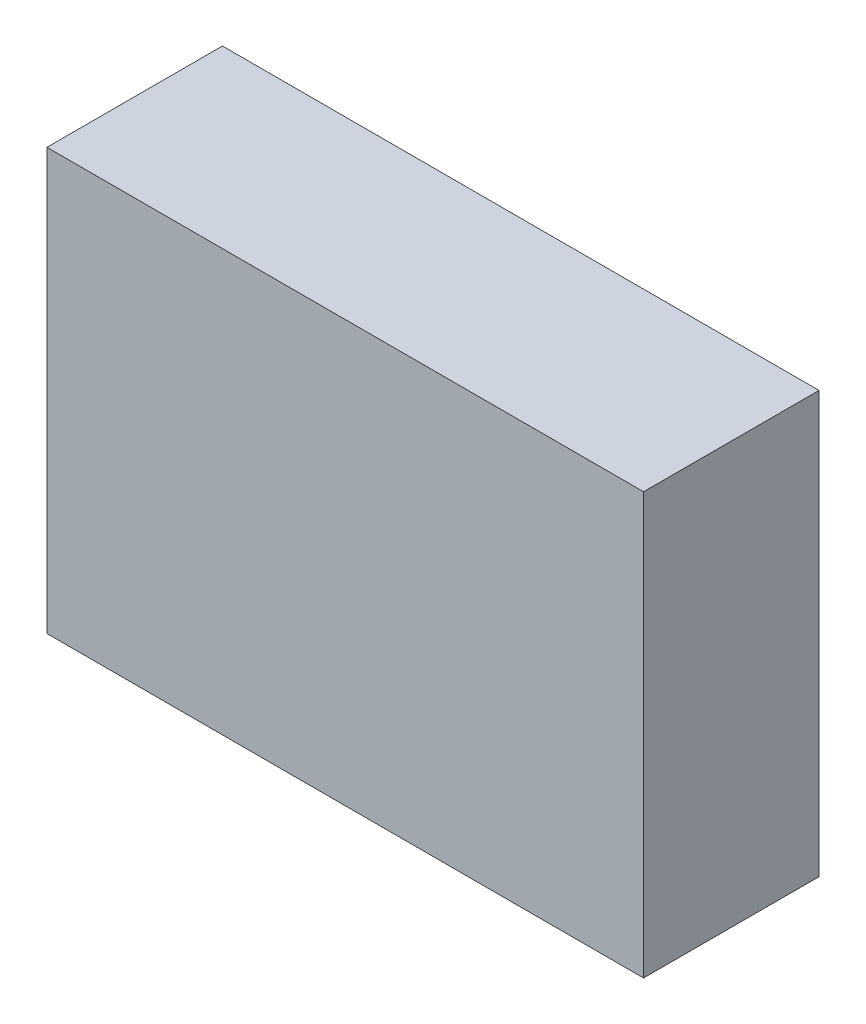
ISO-10303-21;
HEADER;
FILE_DESCRIPTION(('STEP AP214'),'2;1');
FILE_NAME('part.step','',(''),(''),'','','');
FILE_SCHEMA(('AUTOMOTIVE_DESIGN { 1 0 10303 214 1 1 1 1 }'));
ENDSEC;
DATA;
#1=APPLICATION_CONTEXT('core data for automotive mechanical design processes');
#2=APPLICATION_PROTOCOL_DEFINITION('international standard','automotive_design',2000,#1);
#3=PRODUCT_CONTEXT('',#1,'mechanical');
#4=PRODUCT('Part','Part','',(#3));
#5=PRODUCT_RELATED_PRODUCT_CATEGORY('part','',(#4));
#6=PRODUCT_DEFINITION_FORMATION('','',#4);
#7=PRODUCT_DEFINITION_CONTEXT('part definition',#1,'design');
#8=PRODUCT_DEFINITION('design','',#6,#7);
#9=PRODUCT_DEFINITION_SHAPE('','',#8);
#10=(LENGTH_UNIT() NAMED_UNIT(*) SI_UNIT(.MILLI.,.METRE.));
#11=(NAMED_UNIT(*) PLANE_ANGLE_UNIT() SI_UNIT($,.RADIAN.));
#12=(NAMED_UNIT(*) SI_UNIT($,.STERADIAN.) SOLID_ANGLE_UNIT());
#13=UNCERTAINTY_MEASURE_WITH_UNIT(LENGTH_MEASURE(1.E-05),#10,'distance_accuracy_value','');
#14=(GEOMETRIC_REPRESENTATION_CONTEXT(3) GLOBAL_UNCERTAINTY_ASSIGNED_CONTEXT((#13)) GLOBAL_UNIT_ASSIGNED_CONTEXT((#10,
#11,#12)) REPRESENTATION_CONTEXT('',''));
#15=CARTESIAN_POINT('',(0.,0.,0.));
#16=DIRECTION('',(0.,0.,1.));
#17=DIRECTION('',(1.,0.,0.));
#18=AXIS2_PLACEMENT_3D('',#15,#16,#17);
#19=CARTESIAN_POINT('',(2.58,-0.87,0.));
#20=DIRECTION('',(1.,0.,0.));
#21=DIRECTION('',(0.,0.,1.));
#22=AXIS2_PLACEMENT_3D('',#19,#20,#21);
#23=PLANE('',#22);
#24=DIRECTION('',(0.,1.,0.));
#25=VECTOR('',#24,1.);
#26=CARTESIAN_POINT('',(2.58,-0.87,0.1));
#27=LINE('',#26,#25);
#28=CARTESIAN_POINT('',(2.58,-0.87,0.1));
#29=VERTEX_POINT('',#28);
#30=CARTESIAN_POINT('',(2.58,-0.63,0.1));
#31=VERTEX_POINT('',#30);
#32=EDGE_CURVE('E11',#29,#31,#27,.T.);
#33=ORIENTED_EDGE('',*,*,#32,.T.);
#34=DIRECTION('',(0.,0.,1.));
#35=VECTOR('',#34,1.);
#36=CARTESIAN_POINT('',(2.58,-0.63,0.));
#37=LINE('',#36,#35);
#38=CARTESIAN_POINT('',(2.58,-0.63,0.));
#39=VERTEX_POINT('',#38);
#40=EDGE_CURVE('E24',#39,#31,#37,.T.);
#41=ORIENTED_EDGE('',*,*,#40,.F.);
#42=DIRECTION('',(0.,1.,0.));
#43=VECTOR('',#42,1.);
#44=CARTESIAN_POINT('',(2.58,-0.87,0.));
#45=LINE('',#44,#43);
#46=CARTESIAN_POINT('',(2.58,-0.87,0.));
#47=VERTEX_POINT('',#46);
#48=EDGE_CURVE('E86',#47,#39,#45,.T.);
#49=ORIENTED_EDGE('',*,*,#48,.F.);
#50=DIRECTION('',(0.,0.,1.));
#51=VECTOR('',#50,1.);
#52=CARTESIAN_POINT('',(2.58,-0.87,0.));
#53=LINE('',#52,#51);
#54=EDGE_CURVE('E36',#47,#29,#53,.T.);
#55=ORIENTED_EDGE('',*,*,#54,.T.);
#56=EDGE_LOOP('',(#33,#41,#49,#55));
#57=FACE_BOUND('',#56,.T.);
#58=ADVANCED_FACE('F17',(#57),#23,.F.);
#59=CARTESIAN_POINT('',(2.92,-0.87,0.));
#60=DIRECTION('',(1.,0.,0.));
#61=DIRECTION('',(0.,0.,1.));
#62=AXIS2_PLACEMENT_3D('',#59,#60,#61);
#63=PLANE('',#62);
#64=DIRECTION('',(0.,0.,1.));
#65=VECTOR('',#64,1.);
#66=CARTESIAN_POINT('',(2.92,-0.87,0.));
#67=LINE('',#66,#65);
#68=CARTESIAN_POINT('',(2.92,-0.87,0.));
#69=VERTEX_POINT('',#68);
#70=CARTESIAN_POINT('',(2.92,-0.87,0.1));
#71=VERTEX_POINT('',#70);
#72=EDGE_CURVE('E83',#69,#71,#67,.T.);
#73=ORIENTED_EDGE('',*,*,#72,.F.);
#74=DIRECTION('',(0.,1.,0.));
#75=VECTOR('',#74,1.);
#76=CARTESIAN_POINT('',(2.92,-0.87,0.));
#77=LINE('',#76,#75);
#78=CARTESIAN_POINT('',(2.92,-0.63,0.));
#79=VERTEX_POINT('',#78);
#80=EDGE_CURVE('E63',#69,#79,#77,.T.);
#81=ORIENTED_EDGE('',*,*,#80,.T.);
#82=DIRECTION('',(0.,0.,1.));
#83=VECTOR('',#82,1.);
#84=CARTESIAN_POINT('',(2.92,-0.63,0.));
#85=LINE('',#84,#83);
#86=CARTESIAN_POINT('',(2.92,-0.63,0.1));
#87=VERTEX_POINT('',#86);
#88=EDGE_CURVE('E57',#79,#87,#85,.T.);
#89=ORIENTED_EDGE('',*,*,#88,.T.);
#90=DIRECTION('',(0.,1.,0.));
#91=VECTOR('',#90,1.);
#92=CARTESIAN_POINT('',(2.92,-0.87,0.1));
#93=LINE('',#92,#91);
#94=EDGE_CURVE('E60',#71,#87,#93,.T.);
#95=ORIENTED_EDGE('',*,*,#94,.F.);
#96=EDGE_LOOP('',(#73,#81,#89,#95));
#97=FACE_BOUND('',#96,.T.);
#98=ADVANCED_FACE('F59',(#97),#63,.T.);
#99=CARTESIAN_POINT('',(2.58,-0.87,0.));
#100=DIRECTION('',(0.,1.,0.));
#101=DIRECTION('',(0.,0.,1.));
#102=AXIS2_PLACEMENT_3D('',#99,#100,#101);
#103=PLANE('',#102);
#104=ORIENTED_EDGE('',*,*,#72,.T.);
#105=DIRECTION('',(1.,0.,0.));
#106=VECTOR('',#105,1.);
#107=CARTESIAN_POINT('',(2.58,-0.87,0.1));
#108=LINE('',#107,#106);
#109=EDGE_CURVE('E71',#29,#71,#108,.T.);
#110=ORIENTED_EDGE('',*,*,#109,.F.);
#111=ORIENTED_EDGE('',*,*,#54,.F.);
#112=DIRECTION('',(1.,0.,0.));
#113=VECTOR('',#112,1.);
#114=CARTESIAN_POINT('',(2.58,-0.87,0.));
#115=LINE('',#114,#113);
#116=EDGE_CURVE('E76',#47,#69,#115,.T.);
#117=ORIENTED_EDGE('',*,*,#116,.T.);
#118=EDGE_LOOP('',(#104,#110,#111,#117));
#119=FACE_BOUND('',#118,.T.);
#120=ADVANCED_FACE('F91',(#119),#103,.F.);
#121=CARTESIAN_POINT('',(2.58,-0.63,0.));
#122=DIRECTION('',(0.,1.,0.));
#123=DIRECTION('',(0.,0.,1.));
#124=AXIS2_PLACEMENT_3D('',#121,#122,#123);
#125=PLANE('',#124);
#126=DIRECTION('',(1.,0.,0.));
#127=VECTOR('',#126,1.);
#128=CARTESIAN_POINT('',(2.58,-0.63,0.));
#129=LINE('',#128,#127);
#130=EDGE_CURVE('E74',#39,#79,#129,.T.);
#131=ORIENTED_EDGE('',*,*,#130,.F.);
#132=ORIENTED_EDGE('',*,*,#40,.T.);
#133=DIRECTION('',(1.,0.,0.));
#134=VECTOR('',#133,1.);
#135=CARTESIAN_POINT('',(2.58,-0.63,0.1));
#136=LINE('',#135,#134);
#137=EDGE_CURVE('E69',#31,#87,#136,.T.);
#138=ORIENTED_EDGE('',*,*,#137,.T.);
#139=ORIENTED_EDGE('',*,*,#88,.F.);
#140=EDGE_LOOP('',(#131,#132,#138,#139));
#141=FACE_BOUND('',#140,.T.);
#142=ADVANCED_FACE('F73',(#141),#125,.T.);
#143=CARTESIAN_POINT('',(2.58,-0.87,0.));
#144=DIRECTION('',(0.,0.,1.));
#145=DIRECTION('',(1.,0.,0.));
#146=AXIS2_PLACEMENT_3D('',#143,#144,#145);
#147=PLANE('',#146);
#148=ORIENTED_EDGE('',*,*,#130,.T.);
#149=ORIENTED_EDGE('',*,*,#80,.F.);
#150=ORIENTED_EDGE('',*,*,#116,.F.);
#151=ORIENTED_EDGE('',*,*,#48,.T.);
#152=EDGE_LOOP('',(#148,#149,#150,#151));
#153=FACE_BOUND('',#152,.T.);
#154=ADVANCED_FACE('F89',(#153),#147,.F.);
#155=CARTESIAN_POINT('',(2.58,-0.87,0.1));
#156=DIRECTION('',(0.,0.,1.));
#157=DIRECTION('',(1.,0.,0.));
#158=AXIS2_PLACEMENT_3D('',#155,#156,#157);
#159=PLANE('',#158);
#160=ORIENTED_EDGE('',*,*,#32,.F.);
#161=ORIENTED_EDGE('',*,*,#109,.T.);
#162=ORIENTED_EDGE('',*,*,#94,.T.);
#163=ORIENTED_EDGE('',*,*,#137,.F.);
#164=EDGE_LOOP('',(#160,#161,#162,#163));
#165=FACE_BOUND('',#164,.T.);
#166=ADVANCED_FACE('F68',(#165),#159,.T.);
#167=CLOSED_SHELL('',(#58,#98,#120,#142,#154,#166));
#168=MANIFOLD_SOLID_BREP('B1',#167);
#169=ADVANCED_BREP_SHAPE_REPRESENTATION('',(#18,#168),#14);
#170=SHAPE_DEFINITION_REPRESENTATION(#9,#169);
ENDSEC;
END-ISO-10303-21;
